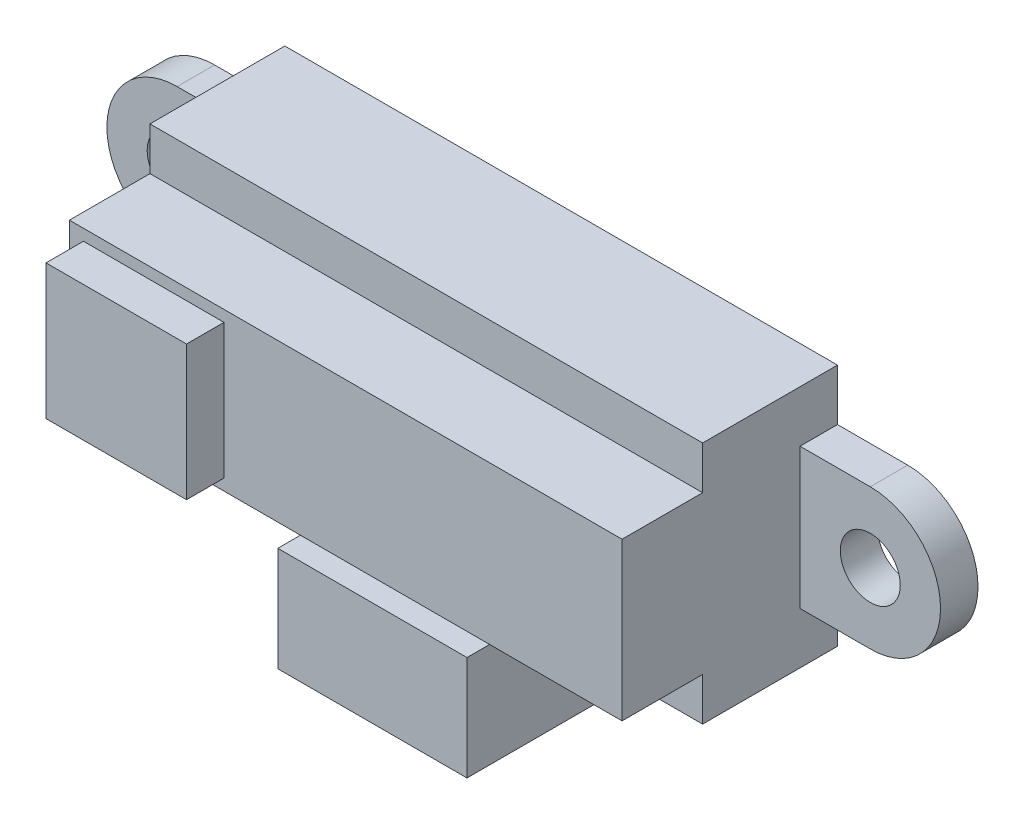
ISO-10303-21;
HEADER;
FILE_DESCRIPTION(('STEP AP214'),'2;1');
FILE_NAME('part.step','',(''),(''),'','','');
FILE_SCHEMA(('AUTOMOTIVE_DESIGN { 1 0 10303 214 1 1 1 1 }'));
ENDSEC;
DATA;
#1=APPLICATION_CONTEXT('core data for automotive mechanical design processes');
#2=APPLICATION_PROTOCOL_DEFINITION('international standard','automotive_design',2000,#1);
#3=PRODUCT_CONTEXT('',#1,'mechanical');
#4=PRODUCT('Part','Part','',(#3));
#5=PRODUCT_RELATED_PRODUCT_CATEGORY('part','',(#4));
#6=PRODUCT_DEFINITION_FORMATION('','',#4);
#7=PRODUCT_DEFINITION_CONTEXT('part definition',#1,'design');
#8=PRODUCT_DEFINITION('design','',#6,#7);
#9=PRODUCT_DEFINITION_SHAPE('','',#8);
#10=(LENGTH_UNIT() NAMED_UNIT(*) SI_UNIT(.MILLI.,.METRE.));
#11=(NAMED_UNIT(*) PLANE_ANGLE_UNIT() SI_UNIT($,.RADIAN.));
#12=(NAMED_UNIT(*) SI_UNIT($,.STERADIAN.) SOLID_ANGLE_UNIT());
#13=UNCERTAINTY_MEASURE_WITH_UNIT(LENGTH_MEASURE(1.E-05),#10,'distance_accuracy_value','');
#14=(GEOMETRIC_REPRESENTATION_CONTEXT(3) GLOBAL_UNCERTAINTY_ASSIGNED_CONTEXT((#13)) GLOBAL_UNIT_ASSIGNED_CONTEXT((#10,
#11,#12)) REPRESENTATION_CONTEXT('',''));
#15=CARTESIAN_POINT('',(0.,0.,0.));
#16=DIRECTION('',(0.,0.,1.));
#17=DIRECTION('',(1.,0.,0.));
#18=AXIS2_PLACEMENT_3D('',#15,#16,#17);
#19=CARTESIAN_POINT('',(-14.75,6.49999999999999,7.2));
#20=DIRECTION('',(1.,0.,0.));
#21=DIRECTION('',(0.,0.,-1.));
#22=AXIS2_PLACEMENT_3D('',#19,#20,#21);
#23=PLANE('',#22);
#24=DIRECTION('',(0.,0.,-1.));
#25=VECTOR('',#24,1.);
#26=CARTESIAN_POINT('',(-14.75,3.75,2.));
#27=LINE('',#26,#25);
#28=CARTESIAN_POINT('',(-14.75,3.75,2.));
#29=VERTEX_POINT('',#28);
#30=CARTESIAN_POINT('',(-14.75,3.75,0.));
#31=VERTEX_POINT('',#30);
#32=EDGE_CURVE('E253',#29,#31,#27,.T.);
#33=ORIENTED_EDGE('',*,*,#32,.F.);
#34=DIRECTION('',(0.,1.,0.));
#35=VECTOR('',#34,1.);
#36=CARTESIAN_POINT('',(-14.75,0.,2.));
#37=LINE('',#36,#35);
#38=CARTESIAN_POINT('',(-14.7499999999999,-3.75,2.));
#39=VERTEX_POINT('',#38);
#40=EDGE_CURVE('E228',#39,#29,#37,.T.);
#41=ORIENTED_EDGE('',*,*,#40,.F.);
#42=DIRECTION('',(0.,0.,-1.));
#43=VECTOR('',#42,1.);
#44=CARTESIAN_POINT('',(-14.7499999999999,-3.75,2.));
#45=LINE('',#44,#43);
#46=CARTESIAN_POINT('',(-14.75,-3.75,0.));
#47=VERTEX_POINT('',#46);
#48=EDGE_CURVE('E224',#39,#47,#45,.T.);
#49=ORIENTED_EDGE('',*,*,#48,.T.);
#50=DIRECTION('',(0.,-1.,0.));
#51=VECTOR('',#50,1.);
#52=CARTESIAN_POINT('',(-14.75,6.49999999999999,0.));
#53=LINE('',#52,#51);
#54=CARTESIAN_POINT('',(-14.75,-6.50000000000001,0.));
#55=VERTEX_POINT('',#54);
#56=EDGE_CURVE('E444',#47,#55,#53,.T.);
#57=ORIENTED_EDGE('',*,*,#56,.T.);
#58=DIRECTION('',(0.,0.,-1.));
#59=VECTOR('',#58,1.);
#60=CARTESIAN_POINT('',(-14.75,-6.50000000000001,7.2));
#61=LINE('',#60,#59);
#62=CARTESIAN_POINT('',(-14.75,-6.50000000000001,7.2));
#63=VERTEX_POINT('',#62);
#64=EDGE_CURVE('E11',#63,#55,#61,.T.);
#65=ORIENTED_EDGE('',*,*,#64,.F.);
#66=DIRECTION('',(0.,-1.,0.));
#67=VECTOR('',#66,1.);
#68=CARTESIAN_POINT('',(-14.75,6.49999999999999,7.2));
#69=LINE('',#68,#67);
#70=CARTESIAN_POINT('',(-14.75,-4.20000000000001,7.2));
#71=VERTEX_POINT('',#70);
#72=EDGE_CURVE('E450',#71,#63,#69,.T.);
#73=ORIENTED_EDGE('',*,*,#72,.F.);
#74=DIRECTION('',(0.,0.,-1.));
#75=VECTOR('',#74,1.);
#76=CARTESIAN_POINT('',(-14.75,-4.20000000000001,11.5));
#77=LINE('',#76,#75);
#78=CARTESIAN_POINT('',(-14.75,-4.20000000000001,11.5));
#79=VERTEX_POINT('',#78);
#80=EDGE_CURVE('E426',#79,#71,#77,.T.);
#81=ORIENTED_EDGE('',*,*,#80,.F.);
#82=DIRECTION('',(0.,-1.,0.));
#83=VECTOR('',#82,1.);
#84=CARTESIAN_POINT('',(-14.75,4.19999999999999,11.5));
#85=LINE('',#84,#83);
#86=CARTESIAN_POINT('',(-14.75,4.19999999999999,11.5));
#87=VERTEX_POINT('',#86);
#88=EDGE_CURVE('E423',#87,#79,#85,.T.);
#89=ORIENTED_EDGE('',*,*,#88,.F.);
#90=DIRECTION('',(0.,0.,-1.));
#91=VECTOR('',#90,1.);
#92=CARTESIAN_POINT('',(-14.75,4.19999999999999,11.5));
#93=LINE('',#92,#91);
#94=CARTESIAN_POINT('',(-14.75,4.19999999999999,7.2));
#95=VERTEX_POINT('',#94);
#96=EDGE_CURVE('E435',#87,#95,#93,.T.);
#97=ORIENTED_EDGE('',*,*,#96,.T.);
#98=CARTESIAN_POINT('',(-14.75,6.49999999999999,7.2));
#99=VERTEX_POINT('',#98);
#100=EDGE_CURVE('E445',#99,#95,#69,.T.);
#101=ORIENTED_EDGE('',*,*,#100,.F.);
#102=DIRECTION('',(0.,0.,-1.));
#103=VECTOR('',#102,1.);
#104=CARTESIAN_POINT('',(-14.75,6.49999999999999,7.2));
#105=LINE('',#104,#103);
#106=CARTESIAN_POINT('',(-14.75,6.49999999999999,0.));
#107=VERTEX_POINT('',#106);
#108=EDGE_CURVE('E463',#99,#107,#105,.T.);
#109=ORIENTED_EDGE('',*,*,#108,.T.);
#110=EDGE_CURVE('E464',#107,#31,#53,.T.);
#111=ORIENTED_EDGE('',*,*,#110,.T.);
#112=EDGE_LOOP('',(#33,#41,#49,#57,#65,#73,#81,#89,#97,#101,#109,#111));
#113=FACE_BOUND('',#112,.T.);
#114=ADVANCED_FACE('F39',(#113),#23,.F.);
#115=CARTESIAN_POINT('',(14.75,6.49999999999999,7.2));
#116=DIRECTION('',(-1.,0.,0.));
#117=DIRECTION('',(0.,0.,1.));
#118=AXIS2_PLACEMENT_3D('',#115,#116,#117);
#119=PLANE('',#118);
#120=DIRECTION('',(0.,0.,-1.));
#121=VECTOR('',#120,1.);
#122=CARTESIAN_POINT('',(14.7499999999999,-3.75,2.));
#123=LINE('',#122,#121);
#124=CARTESIAN_POINT('',(14.7499999999999,-3.75,2.));
#125=VERTEX_POINT('',#124);
#126=CARTESIAN_POINT('',(14.7499999999999,-3.75,0.));
#127=VERTEX_POINT('',#126);
#128=EDGE_CURVE('E291',#125,#127,#123,.T.);
#129=ORIENTED_EDGE('',*,*,#128,.F.);
#130=DIRECTION('',(0.,-1.,0.));
#131=VECTOR('',#130,1.);
#132=CARTESIAN_POINT('',(14.75,0.,2.));
#133=LINE('',#132,#131);
#134=CARTESIAN_POINT('',(14.75,3.75,2.));
#135=VERTEX_POINT('',#134);
#136=EDGE_CURVE('E261',#135,#125,#133,.T.);
#137=ORIENTED_EDGE('',*,*,#136,.F.);
#138=DIRECTION('',(0.,0.,-1.));
#139=VECTOR('',#138,1.);
#140=CARTESIAN_POINT('',(14.75,3.75,2.));
#141=LINE('',#140,#139);
#142=CARTESIAN_POINT('',(14.75,3.75,0.));
#143=VERTEX_POINT('',#142);
#144=EDGE_CURVE('E274',#135,#143,#141,.T.);
#145=ORIENTED_EDGE('',*,*,#144,.T.);
#146=DIRECTION('',(0.,1.,0.));
#147=VECTOR('',#146,1.);
#148=CARTESIAN_POINT('',(14.75,6.49999999999999,0.));
#149=LINE('',#148,#147);
#150=CARTESIAN_POINT('',(14.75,6.49999999999999,0.));
#151=VERTEX_POINT('',#150);
#152=EDGE_CURVE('E471',#143,#151,#149,.T.);
#153=ORIENTED_EDGE('',*,*,#152,.T.);
#154=DIRECTION('',(0.,0.,-1.));
#155=VECTOR('',#154,1.);
#156=CARTESIAN_POINT('',(14.75,6.49999999999999,7.2));
#157=LINE('',#156,#155);
#158=CARTESIAN_POINT('',(14.75,6.49999999999999,7.2));
#159=VERTEX_POINT('',#158);
#160=EDGE_CURVE('E482',#159,#151,#157,.T.);
#161=ORIENTED_EDGE('',*,*,#160,.F.);
#162=DIRECTION('',(0.,1.,0.));
#163=VECTOR('',#162,1.);
#164=CARTESIAN_POINT('',(14.75,6.49999999999999,7.2));
#165=LINE('',#164,#163);
#166=CARTESIAN_POINT('',(14.75,4.19999999999999,7.2));
#167=VERTEX_POINT('',#166);
#168=EDGE_CURVE('E455',#167,#159,#165,.T.);
#169=ORIENTED_EDGE('',*,*,#168,.F.);
#170=DIRECTION('',(0.,0.,-1.));
#171=VECTOR('',#170,1.);
#172=CARTESIAN_POINT('',(14.75,4.19999999999999,11.5));
#173=LINE('',#172,#171);
#174=CARTESIAN_POINT('',(14.75,4.19999999999999,11.5));
#175=VERTEX_POINT('',#174);
#176=EDGE_CURVE('E438',#175,#167,#173,.T.);
#177=ORIENTED_EDGE('',*,*,#176,.F.);
#178=DIRECTION('',(0.,1.,0.));
#179=VECTOR('',#178,1.);
#180=CARTESIAN_POINT('',(14.7499999999999,-4.20000000000001,11.5));
#181=LINE('',#180,#179);
#182=CARTESIAN_POINT('',(14.7499999999999,-4.20000000000001,11.5));
#183=VERTEX_POINT('',#182);
#184=EDGE_CURVE('E415',#183,#175,#181,.T.);
#185=ORIENTED_EDGE('',*,*,#184,.F.);
#186=DIRECTION('',(0.,0.,-1.));
#187=VECTOR('',#186,1.);
#188=CARTESIAN_POINT('',(14.7499999999999,-4.20000000000001,11.5));
#189=LINE('',#188,#187);
#190=CARTESIAN_POINT('',(14.7499999999999,-4.20000000000001,7.2));
#191=VERTEX_POINT('',#190);
#192=EDGE_CURVE('E441',#183,#191,#189,.T.);
#193=ORIENTED_EDGE('',*,*,#192,.T.);
#194=CARTESIAN_POINT('',(14.75,-6.50000000000001,7.2));
#195=VERTEX_POINT('',#194);
#196=EDGE_CURVE('E456',#195,#191,#165,.T.);
#197=ORIENTED_EDGE('',*,*,#196,.F.);
#198=DIRECTION('',(0.,0.,-1.));
#199=VECTOR('',#198,1.);
#200=CARTESIAN_POINT('',(14.75,-6.50000000000001,7.2));
#201=LINE('',#200,#199);
#202=CARTESIAN_POINT('',(14.75,-6.50000000000001,0.));
#203=VERTEX_POINT('',#202);
#204=EDGE_CURVE('E47',#195,#203,#201,.T.);
#205=ORIENTED_EDGE('',*,*,#204,.T.);
#206=EDGE_CURVE('E472',#203,#127,#149,.T.);
#207=ORIENTED_EDGE('',*,*,#206,.T.);
#208=EDGE_LOOP('',(#129,#137,#145,#153,#161,#169,#177,#185,#193,#197,#205,#207));
#209=FACE_BOUND('',#208,.T.);
#210=ADVANCED_FACE('F492',(#209),#119,.F.);
#211=CARTESIAN_POINT('',(0.,0.,11.5));
#212=DIRECTION('',(0.,0.,1.));
#213=DIRECTION('',(1.,0.,0.));
#214=AXIS2_PLACEMENT_3D('',#211,#212,#213);
#215=PLANE('',#214);
#216=DIRECTION('',(1.,0.,0.));
#217=VECTOR('',#216,1.);
#218=CARTESIAN_POINT('',(-14.75,-4.20000000000001,11.5));
#219=LINE('',#218,#217);
#220=EDGE_CURVE('E411',#79,#183,#219,.T.);
#221=ORIENTED_EDGE('',*,*,#220,.T.);
#222=ORIENTED_EDGE('',*,*,#184,.T.);
#223=DIRECTION('',(1.,0.,0.));
#224=VECTOR('',#223,1.);
#225=CARTESIAN_POINT('',(-14.75,4.19999999999999,11.5));
#226=LINE('',#225,#224);
#227=EDGE_CURVE('E419',#87,#175,#226,.T.);
#228=ORIENTED_EDGE('',*,*,#227,.F.);
#229=ORIENTED_EDGE('',*,*,#88,.T.);
#230=EDGE_LOOP('',(#221,#222,#228,#229));
#231=FACE_BOUND('',#230,.T.);
#232=DIRECTION('',(1.,0.,0.));
#233=VECTOR('',#232,1.);
#234=CARTESIAN_POINT('',(-14.,-3.60000000000001,11.5));
#235=LINE('',#234,#233);
#236=CARTESIAN_POINT('',(-14.,-3.60000000000001,11.5));
#237=VERTEX_POINT('',#236);
#238=CARTESIAN_POINT('',(-6.50000000000001,-3.60000000000001,11.5));
#239=VERTEX_POINT('',#238);
#240=EDGE_CURVE('E388',#237,#239,#235,.T.);
#241=ORIENTED_EDGE('',*,*,#240,.F.);
#242=DIRECTION('',(0.,-1.,0.));
#243=VECTOR('',#242,1.);
#244=CARTESIAN_POINT('',(-14.,3.59999999999999,11.5));
#245=LINE('',#244,#243);
#246=CARTESIAN_POINT('',(-14.,3.59999999999999,11.5));
#247=VERTEX_POINT('',#246);
#248=EDGE_CURVE('E369',#247,#237,#245,.T.);
#249=ORIENTED_EDGE('',*,*,#248,.F.);
#250=DIRECTION('',(-1.,0.,0.));
#251=VECTOR('',#250,1.);
#252=CARTESIAN_POINT('',(-6.50000000000001,3.59999999999999,11.5));
#253=LINE('',#252,#251);
#254=CARTESIAN_POINT('',(-6.50000000000001,3.59999999999999,11.5));
#255=VERTEX_POINT('',#254);
#256=EDGE_CURVE('E375',#255,#247,#253,.T.);
#257=ORIENTED_EDGE('',*,*,#256,.F.);
#258=DIRECTION('',(0.,1.,0.));
#259=VECTOR('',#258,1.);
#260=CARTESIAN_POINT('',(-6.50000000000001,-3.60000000000001,11.5));
#261=LINE('',#260,#259);
#262=EDGE_CURVE('E391',#239,#255,#261,.T.);
#263=ORIENTED_EDGE('',*,*,#262,.F.);
#264=EDGE_LOOP('',(#241,#249,#257,#263));
#265=FACE_BOUND('',#264,.T.);
#266=ADVANCED_FACE('F532',(#231,#265),#215,.T.);
#267=CARTESIAN_POINT('',(0.,0.,7.2));
#268=DIRECTION('',(0.,0.,1.));
#269=DIRECTION('',(1.,0.,0.));
#270=AXIS2_PLACEMENT_3D('',#267,#268,#269);
#271=PLANE('',#270);
#272=ORIENTED_EDGE('',*,*,#100,.T.);
#273=DIRECTION('',(1.,0.,0.));
#274=VECTOR('',#273,1.);
#275=CARTESIAN_POINT('',(-14.75,4.19999999999999,7.2));
#276=LINE('',#275,#274);
#277=EDGE_CURVE('E416',#95,#167,#276,.T.);
#278=ORIENTED_EDGE('',*,*,#277,.T.);
#279=ORIENTED_EDGE('',*,*,#168,.T.);
#280=DIRECTION('',(-1.,0.,0.));
#281=VECTOR('',#280,1.);
#282=CARTESIAN_POINT('',(-14.75,6.49999999999999,7.2));
#283=LINE('',#282,#281);
#284=EDGE_CURVE('E460',#159,#99,#283,.T.);
#285=ORIENTED_EDGE('',*,*,#284,.T.);
#286=EDGE_LOOP('',(#272,#278,#279,#285));
#287=FACE_BOUND('',#286,.T.);
#288=ADVANCED_FACE('F633',(#287),#271,.T.);
#289=CARTESIAN_POINT('',(-14.75,-6.50000000000001,7.2));
#290=DIRECTION('',(0.,1.,0.));
#291=DIRECTION('',(0.,0.,1.));
#292=AXIS2_PLACEMENT_3D('',#289,#290,#291);
#293=PLANE('',#292);
#294=DIRECTION('',(0.,0.,-1.));
#295=VECTOR('',#294,1.);
#296=CARTESIAN_POINT('',(-5.05000000000002,-6.50000000000001,4.50000000000007));
#297=LINE('',#296,#295);
#298=CARTESIAN_POINT('',(-5.05000000000002,-6.50000000000001,7.2));
#299=VERTEX_POINT('',#298);
#300=CARTESIAN_POINT('',(-5.05000000000002,-6.50000000000001,3.30000000000007));
#301=VERTEX_POINT('',#300);
#302=EDGE_CURVE('E354',#299,#301,#297,.T.);
#303=ORIENTED_EDGE('',*,*,#302,.F.);
#304=DIRECTION('',(1.,0.,0.));
#305=VECTOR('',#304,1.);
#306=CARTESIAN_POINT('',(-14.75,-6.50000000000001,7.2));
#307=LINE('',#306,#305);
#308=EDGE_CURVE('E451',#63,#299,#307,.T.);
#309=ORIENTED_EDGE('',*,*,#308,.F.);
#310=ORIENTED_EDGE('',*,*,#64,.T.);
#311=DIRECTION('',(1.,0.,0.));
#312=VECTOR('',#311,1.);
#313=CARTESIAN_POINT('',(-14.75,-6.50000000000001,0.));
#314=LINE('',#313,#312);
#315=EDGE_CURVE('E468',#55,#203,#314,.T.);
#316=ORIENTED_EDGE('',*,*,#315,.T.);
#317=ORIENTED_EDGE('',*,*,#204,.F.);
#318=CARTESIAN_POINT('',(5.04999999999998,-6.50000000000001,7.2));
#319=VERTEX_POINT('',#318);
#320=EDGE_CURVE('E449',#319,#195,#307,.T.);
#321=ORIENTED_EDGE('',*,*,#320,.F.);
#322=DIRECTION('',(0.,0.,-1.));
#323=VECTOR('',#322,1.);
#324=CARTESIAN_POINT('',(5.04999999999998,-6.50000000000001,4.50000000000007));
#325=LINE('',#324,#323);
#326=CARTESIAN_POINT('',(5.04999999999998,-6.50000000000001,3.30000000000007));
#327=VERTEX_POINT('',#326);
#328=EDGE_CURVE('E357',#319,#327,#325,.T.);
#329=ORIENTED_EDGE('',*,*,#328,.T.);
#330=DIRECTION('',(-1.,0.,0.));
#331=VECTOR('',#330,1.);
#332=CARTESIAN_POINT('',(5.04999999999998,-6.50000000000001,3.30000000000007));
#333=LINE('',#332,#331);
#334=EDGE_CURVE('E350',#327,#301,#333,.T.);
#335=ORIENTED_EDGE('',*,*,#334,.T.);
#336=EDGE_LOOP('',(#303,#309,#310,#316,#317,#321,#329,#335));
#337=FACE_BOUND('',#336,.T.);
#338=ADVANCED_FACE('F650',(#337),#293,.F.);
#339=CARTESIAN_POINT('',(-14.75,6.49999999999999,7.2));
#340=DIRECTION('',(0.,-1.,0.));
#341=DIRECTION('',(0.,0.,-1.));
#342=AXIS2_PLACEMENT_3D('',#339,#340,#341);
#343=PLANE('',#342);
#344=DIRECTION('',(-1.,0.,0.));
#345=VECTOR('',#344,1.);
#346=CARTESIAN_POINT('',(-14.75,6.49999999999999,0.));
#347=LINE('',#346,#345);
#348=EDGE_CURVE('E476',#151,#107,#347,.T.);
#349=ORIENTED_EDGE('',*,*,#348,.T.);
#350=ORIENTED_EDGE('',*,*,#108,.F.);
#351=ORIENTED_EDGE('',*,*,#284,.F.);
#352=ORIENTED_EDGE('',*,*,#160,.T.);
#353=EDGE_LOOP('',(#349,#350,#351,#352));
#354=FACE_BOUND('',#353,.T.);
#355=ADVANCED_FACE('F645',(#354),#343,.F.);
#356=DIRECTION('',(0.,1.,0.));
#357=VECTOR('',#356,1.);
#358=CARTESIAN_POINT('',(-5.05000000000001,-5.96026463822464,7.2));
#359=LINE('',#358,#357);
#360=CARTESIAN_POINT('',(-5.05000000000001,-5.96026463822464,7.2));
#361=VERTEX_POINT('',#360);
#362=EDGE_CURVE('E296',#299,#361,#359,.T.);
#363=ORIENTED_EDGE('',*,*,#362,.T.);
#364=DIRECTION('',(1.,0.,0.));
#365=VECTOR('',#364,1.);
#366=CARTESIAN_POINT('',(-5.05000000000001,-5.96026463822464,7.2));
#367=LINE('',#366,#365);
#368=CARTESIAN_POINT('',(5.04999999999998,-5.96026463822464,7.2));
#369=VERTEX_POINT('',#368);
#370=EDGE_CURVE('E312',#361,#369,#367,.T.);
#371=ORIENTED_EDGE('',*,*,#370,.T.);
#372=DIRECTION('',(0.,1.,0.));
#373=VECTOR('',#372,1.);
#374=CARTESIAN_POINT('',(5.04999999999998,-5.96026463822464,7.2));
#375=LINE('',#374,#373);
#376=EDGE_CURVE('E295',#319,#369,#375,.T.);
#377=ORIENTED_EDGE('',*,*,#376,.F.);
#378=ORIENTED_EDGE('',*,*,#320,.T.);
#379=ORIENTED_EDGE('',*,*,#196,.T.);
#380=DIRECTION('',(1.,0.,0.));
#381=VECTOR('',#380,1.);
#382=CARTESIAN_POINT('',(-14.75,-4.20000000000001,7.2));
#383=LINE('',#382,#381);
#384=EDGE_CURVE('E410',#71,#191,#383,.T.);
#385=ORIENTED_EDGE('',*,*,#384,.F.);
#386=ORIENTED_EDGE('',*,*,#72,.T.);
#387=ORIENTED_EDGE('',*,*,#308,.T.);
#388=EDGE_LOOP('',(#363,#371,#377,#378,#379,#385,#386,#387));
#389=FACE_BOUND('',#388,.T.);
#390=ADVANCED_FACE('F642',(#389),#271,.T.);
#391=CARTESIAN_POINT('',(0.,0.,0.));
#392=DIRECTION('',(0.,0.,1.));
#393=DIRECTION('',(1.,0.,0.));
#394=AXIS2_PLACEMENT_3D('',#391,#392,#393);
#395=PLANE('',#394);
#396=ORIENTED_EDGE('',*,*,#110,.F.);
#397=ORIENTED_EDGE('',*,*,#348,.F.);
#398=ORIENTED_EDGE('',*,*,#152,.F.);
#399=DIRECTION('',(-1.,0.,0.));
#400=VECTOR('',#399,1.);
#401=CARTESIAN_POINT('',(18.4999999999999,3.75,0.));
#402=LINE('',#401,#400);
#403=CARTESIAN_POINT('',(18.4999999999999,3.75,0.));
#404=VERTEX_POINT('',#403);
#405=EDGE_CURVE('E62',#404,#143,#402,.T.);
#406=ORIENTED_EDGE('',*,*,#405,.F.);
#407=CARTESIAN_POINT('',(18.4999999999999,0.,0.));
#408=DIRECTION('',(0.,0.,1.));
#409=DIRECTION('',(1.,0.,0.));
#410=AXIS2_PLACEMENT_3D('',#407,#408,#409);
#411=CIRCLE('',#410,3.75);
#412=CARTESIAN_POINT('',(18.4999999999999,-3.75,0.));
#413=VERTEX_POINT('',#412);
#414=EDGE_CURVE('E277',#413,#404,#411,.T.);
#415=ORIENTED_EDGE('',*,*,#414,.F.);
#416=DIRECTION('',(1.,0.,0.));
#417=VECTOR('',#416,1.);
#418=CARTESIAN_POINT('',(18.4999999999999,-3.75,0.));
#419=LINE('',#418,#417);
#420=EDGE_CURVE('E259',#127,#413,#419,.T.);
#421=ORIENTED_EDGE('',*,*,#420,.F.);
#422=ORIENTED_EDGE('',*,*,#206,.F.);
#423=ORIENTED_EDGE('',*,*,#315,.F.);
#424=ORIENTED_EDGE('',*,*,#56,.F.);
#425=DIRECTION('',(1.,0.,0.));
#426=VECTOR('',#425,1.);
#427=CARTESIAN_POINT('',(-18.4999999999999,-3.75,0.));
#428=LINE('',#427,#426);
#429=CARTESIAN_POINT('',(-18.4999999999999,-3.75,0.));
#430=VERTEX_POINT('',#429);
#431=EDGE_CURVE('E54',#430,#47,#428,.T.);
#432=ORIENTED_EDGE('',*,*,#431,.F.);
#433=CARTESIAN_POINT('',(-18.4999999999999,0.,0.));
#434=DIRECTION('',(0.,0.,1.));
#435=DIRECTION('',(-1.,0.,0.));
#436=AXIS2_PLACEMENT_3D('',#433,#434,#435);
#437=CIRCLE('',#436,3.75);
#438=CARTESIAN_POINT('',(-18.4999999999999,3.75,0.));
#439=VERTEX_POINT('',#438);
#440=EDGE_CURVE('E244',#439,#430,#437,.T.);
#441=ORIENTED_EDGE('',*,*,#440,.F.);
#442=DIRECTION('',(-1.,0.,0.));
#443=VECTOR('',#442,1.);
#444=CARTESIAN_POINT('',(-18.4999999999999,3.75,0.));
#445=LINE('',#444,#443);
#446=EDGE_CURVE('E240',#31,#439,#445,.T.);
#447=ORIENTED_EDGE('',*,*,#446,.F.);
#448=EDGE_LOOP('',(#396,#397,#398,#406,#415,#421,#422,#423,#424,#432,#441,#447));
#449=FACE_BOUND('',#448,.T.);
#450=CARTESIAN_POINT('',(18.4999999999999,0.,0.));
#451=DIRECTION('',(0.,0.,1.));
#452=DIRECTION('',(1.,0.,0.));
#453=AXIS2_PLACEMENT_3D('',#450,#451,#452);
#454=CIRCLE('',#453,1.6);
#455=CARTESIAN_POINT('',(20.0999999999999,0.,0.));
#456=VERTEX_POINT('',#455);
#457=EDGE_CURVE('E246',#456,#456,#454,.T.);
#458=ORIENTED_EDGE('',*,*,#457,.T.);
#459=EDGE_LOOP('',(#458));
#460=FACE_BOUND('',#459,.T.);
#461=CARTESIAN_POINT('',(-18.4999999999999,0.,0.));
#462=DIRECTION('',(0.,0.,1.));
#463=DIRECTION('',(-1.,0.,0.));
#464=AXIS2_PLACEMENT_3D('',#461,#462,#463);
#465=CIRCLE('',#464,1.6);
#466=CARTESIAN_POINT('',(-20.0999999999999,0.,0.));
#467=VERTEX_POINT('',#466);
#468=EDGE_CURVE('E553',#467,#467,#465,.T.);
#469=ORIENTED_EDGE('',*,*,#468,.T.);
#470=EDGE_LOOP('',(#469));
#471=FACE_BOUND('',#470,.T.);
#472=ADVANCED_FACE('F498',(#449,#460,#471),#395,.F.);
#473=CARTESIAN_POINT('',(-14.75,-4.20000000000001,11.5));
#474=DIRECTION('',(0.,1.,0.));
#475=DIRECTION('',(0.,0.,1.));
#476=AXIS2_PLACEMENT_3D('',#473,#474,#475);
#477=PLANE('',#476);
#478=ORIENTED_EDGE('',*,*,#384,.T.);
#479=ORIENTED_EDGE('',*,*,#192,.F.);
#480=ORIENTED_EDGE('',*,*,#220,.F.);
#481=ORIENTED_EDGE('',*,*,#80,.T.);
#482=EDGE_LOOP('',(#478,#479,#480,#481));
#483=FACE_BOUND('',#482,.T.);
#484=ADVANCED_FACE('F637',(#483),#477,.F.);
#485=CARTESIAN_POINT('',(-14.75,4.19999999999999,11.5));
#486=DIRECTION('',(0.,1.,0.));
#487=DIRECTION('',(0.,0.,1.));
#488=AXIS2_PLACEMENT_3D('',#485,#486,#487);
#489=PLANE('',#488);
#490=ORIENTED_EDGE('',*,*,#277,.F.);
#491=ORIENTED_EDGE('',*,*,#96,.F.);
#492=ORIENTED_EDGE('',*,*,#227,.T.);
#493=ORIENTED_EDGE('',*,*,#176,.T.);
#494=EDGE_LOOP('',(#490,#491,#492,#493));
#495=FACE_BOUND('',#494,.T.);
#496=ADVANCED_FACE('F629',(#495),#489,.T.);
#497=CARTESIAN_POINT('',(-14.,3.59999999999999,13.5));
#498=DIRECTION('',(1.,0.,0.));
#499=DIRECTION('',(0.,1.,0.));
#500=AXIS2_PLACEMENT_3D('',#497,#498,#499);
#501=PLANE('',#500);
#502=ORIENTED_EDGE('',*,*,#248,.T.);
#503=DIRECTION('',(0.,0.,-1.));
#504=VECTOR('',#503,1.);
#505=CARTESIAN_POINT('',(-14.,-3.60000000000001,13.5));
#506=LINE('',#505,#504);
#507=CARTESIAN_POINT('',(-14.,-3.60000000000001,13.5));
#508=VERTEX_POINT('',#507);
#509=EDGE_CURVE('E407',#508,#237,#506,.T.);
#510=ORIENTED_EDGE('',*,*,#509,.F.);
#511=DIRECTION('',(0.,-1.,0.));
#512=VECTOR('',#511,1.);
#513=CARTESIAN_POINT('',(-14.,3.59999999999999,13.5));
#514=LINE('',#513,#512);
#515=CARTESIAN_POINT('',(-14.,3.59999999999999,13.5));
#516=VERTEX_POINT('',#515);
#517=EDGE_CURVE('E370',#516,#508,#514,.T.);
#518=ORIENTED_EDGE('',*,*,#517,.F.);
#519=DIRECTION('',(0.,0.,-1.));
#520=VECTOR('',#519,1.);
#521=CARTESIAN_POINT('',(-14.,3.59999999999999,13.5));
#522=LINE('',#521,#520);
#523=EDGE_CURVE('E384',#516,#247,#522,.T.);
#524=ORIENTED_EDGE('',*,*,#523,.T.);
#525=EDGE_LOOP('',(#502,#510,#518,#524));
#526=FACE_BOUND('',#525,.T.);
#527=ADVANCED_FACE('F625',(#526),#501,.F.);
#528=CARTESIAN_POINT('',(-14.,-3.60000000000001,13.5));
#529=DIRECTION('',(0.,1.,0.));
#530=DIRECTION('',(0.,0.,1.));
#531=AXIS2_PLACEMENT_3D('',#528,#529,#530);
#532=PLANE('',#531);
#533=ORIENTED_EDGE('',*,*,#240,.T.);
#534=DIRECTION('',(0.,0.,-1.));
#535=VECTOR('',#534,1.);
#536=CARTESIAN_POINT('',(-6.50000000000001,-3.60000000000001,13.5));
#537=LINE('',#536,#535);
#538=CARTESIAN_POINT('',(-6.50000000000001,-3.60000000000001,13.5));
#539=VERTEX_POINT('',#538);
#540=EDGE_CURVE('E403',#539,#239,#537,.T.);
#541=ORIENTED_EDGE('',*,*,#540,.F.);
#542=DIRECTION('',(1.,0.,0.));
#543=VECTOR('',#542,1.);
#544=CARTESIAN_POINT('',(-14.,-3.60000000000001,13.5));
#545=LINE('',#544,#543);
#546=EDGE_CURVE('E374',#508,#539,#545,.T.);
#547=ORIENTED_EDGE('',*,*,#546,.F.);
#548=ORIENTED_EDGE('',*,*,#509,.T.);
#549=EDGE_LOOP('',(#533,#541,#547,#548));
#550=FACE_BOUND('',#549,.T.);
#551=ADVANCED_FACE('F621',(#550),#532,.F.);
#552=CARTESIAN_POINT('',(-6.50000000000001,-3.60000000000001,13.5));
#553=DIRECTION('',(-1.,0.,0.));
#554=DIRECTION('',(0.,-1.,0.));
#555=AXIS2_PLACEMENT_3D('',#552,#553,#554);
#556=PLANE('',#555);
#557=ORIENTED_EDGE('',*,*,#262,.T.);
#558=DIRECTION('',(0.,0.,-1.));
#559=VECTOR('',#558,1.);
#560=CARTESIAN_POINT('',(-6.50000000000001,3.59999999999999,13.5));
#561=LINE('',#560,#559);
#562=CARTESIAN_POINT('',(-6.50000000000001,3.59999999999999,13.5));
#563=VERTEX_POINT('',#562);
#564=EDGE_CURVE('E400',#563,#255,#561,.T.);
#565=ORIENTED_EDGE('',*,*,#564,.F.);
#566=DIRECTION('',(0.,1.,0.));
#567=VECTOR('',#566,1.);
#568=CARTESIAN_POINT('',(-6.50000000000001,-3.60000000000001,13.5));
#569=LINE('',#568,#567);
#570=EDGE_CURVE('E378',#539,#563,#569,.T.);
#571=ORIENTED_EDGE('',*,*,#570,.F.);
#572=ORIENTED_EDGE('',*,*,#540,.T.);
#573=EDGE_LOOP('',(#557,#565,#571,#572));
#574=FACE_BOUND('',#573,.T.);
#575=ADVANCED_FACE('F617',(#574),#556,.F.);
#576=CARTESIAN_POINT('',(-6.50000000000001,3.59999999999999,13.5));
#577=DIRECTION('',(0.,-1.,0.));
#578=DIRECTION('',(1.,0.,0.));
#579=AXIS2_PLACEMENT_3D('',#576,#577,#578);
#580=PLANE('',#579);
#581=ORIENTED_EDGE('',*,*,#256,.T.);
#582=ORIENTED_EDGE('',*,*,#523,.F.);
#583=DIRECTION('',(-1.,0.,0.));
#584=VECTOR('',#583,1.);
#585=CARTESIAN_POINT('',(-6.50000000000001,3.59999999999999,13.5));
#586=LINE('',#585,#584);
#587=EDGE_CURVE('E381',#563,#516,#586,.T.);
#588=ORIENTED_EDGE('',*,*,#587,.F.);
#589=ORIENTED_EDGE('',*,*,#564,.T.);
#590=EDGE_LOOP('',(#581,#582,#588,#589));
#591=FACE_BOUND('',#590,.T.);
#592=ADVANCED_FACE('F613',(#591),#580,.F.);
#593=CARTESIAN_POINT('',(0.,0.,13.5));
#594=DIRECTION('',(0.,0.,1.));
#595=DIRECTION('',(1.,0.,0.));
#596=AXIS2_PLACEMENT_3D('',#593,#594,#595);
#597=PLANE('',#596);
#598=ORIENTED_EDGE('',*,*,#517,.T.);
#599=ORIENTED_EDGE('',*,*,#546,.T.);
#600=ORIENTED_EDGE('',*,*,#570,.T.);
#601=ORIENTED_EDGE('',*,*,#587,.T.);
#602=EDGE_LOOP('',(#598,#599,#600,#601));
#603=FACE_BOUND('',#602,.T.);
#604=ADVANCED_FACE('F609',(#603),#597,.T.);
#605=CARTESIAN_POINT('',(-5.05000000000001,-12.4,4.50000000000007));
#606=DIRECTION('',(1.,0.,0.));
#607=DIRECTION('',(0.,1.,0.));
#608=AXIS2_PLACEMENT_3D('',#605,#606,#607);
#609=PLANE('',#608);
#610=DIRECTION('',(0.,-1.,0.));
#611=VECTOR('',#610,1.);
#612=CARTESIAN_POINT('',(-5.05000000000001,-12.4,3.30000000000007));
#613=LINE('',#612,#611);
#614=CARTESIAN_POINT('',(-5.05000000000001,-12.4,3.30000000000007));
#615=VERTEX_POINT('',#614);
#616=EDGE_CURVE('E331',#301,#615,#613,.T.);
#617=ORIENTED_EDGE('',*,*,#616,.T.);
#618=DIRECTION('',(0.,0.,-1.));
#619=VECTOR('',#618,1.);
#620=CARTESIAN_POINT('',(-5.05000000000001,-12.4,4.50000000000007));
#621=LINE('',#620,#619);
#622=CARTESIAN_POINT('',(-5.05000000000001,-12.4,10.077134600143));
#623=VERTEX_POINT('',#622);
#624=EDGE_CURVE('E365',#623,#615,#621,.T.);
#625=ORIENTED_EDGE('',*,*,#624,.F.);
#626=DIRECTION('',(0.,-1.,0.));
#627=VECTOR('',#626,1.);
#628=CARTESIAN_POINT('',(-5.05000000000001,-12.4,10.077134600143));
#629=LINE('',#628,#627);
#630=CARTESIAN_POINT('',(-5.05000000000001,-6.83047926311858,10.077134600143));
#631=VERTEX_POINT('',#630);
#632=EDGE_CURVE('E308',#631,#623,#629,.T.);
#633=ORIENTED_EDGE('',*,*,#632,.F.);
#634=DIRECTION('',(0.,0.,1.));
#635=VECTOR('',#634,1.);
#636=CARTESIAN_POINT('',(-5.05000000000001,-6.83047926311858,10.077134600143));
#637=LINE('',#636,#635);
#638=CARTESIAN_POINT('',(-5.05000000000001,-6.83047926311858,8.50886516491374));
#639=VERTEX_POINT('',#638);
#640=EDGE_CURVE('E304',#639,#631,#637,.T.);
#641=ORIENTED_EDGE('',*,*,#640,.F.);
#642=DIRECTION('',(0.,-0.553659307847889,0.832743280269133));
#643=VECTOR('',#642,1.);
#644=CARTESIAN_POINT('',(-5.05000000000001,-6.83047926311858,8.50886516491374));
#645=LINE('',#644,#643);
#646=EDGE_CURVE('E299',#361,#639,#645,.T.);
#647=ORIENTED_EDGE('',*,*,#646,.F.);
#648=ORIENTED_EDGE('',*,*,#362,.F.);
#649=ORIENTED_EDGE('',*,*,#302,.T.);
#650=EDGE_LOOP('',(#617,#625,#633,#641,#647,#648,#649));
#651=FACE_BOUND('',#650,.T.);
#652=ADVANCED_FACE('F605',(#651),#609,.F.);
#653=CARTESIAN_POINT('',(-5.05000000000001,-12.4,4.50000000000007));
#654=DIRECTION('',(0.,1.,0.));
#655=DIRECTION('',(-1.,0.,0.));
#656=AXIS2_PLACEMENT_3D('',#653,#654,#655);
#657=PLANE('',#656);
#658=DIRECTION('',(1.,0.,0.));
#659=VECTOR('',#658,1.);
#660=CARTESIAN_POINT('',(-5.05000000000001,-12.4,3.30000000000007));
#661=LINE('',#660,#659);
#662=CARTESIAN_POINT('',(5.04999999999998,-12.4,3.30000000000007));
#663=VERTEX_POINT('',#662);
#664=EDGE_CURVE('E343',#615,#663,#661,.T.);
#665=ORIENTED_EDGE('',*,*,#664,.T.);
#666=DIRECTION('',(0.,0.,-1.));
#667=VECTOR('',#666,1.);
#668=CARTESIAN_POINT('',(5.04999999999998,-12.4,4.50000000000007));
#669=LINE('',#668,#667);
#670=CARTESIAN_POINT('',(5.04999999999998,-12.4,10.077134600143));
#671=VERTEX_POINT('',#670);
#672=EDGE_CURVE('E361',#671,#663,#669,.T.);
#673=ORIENTED_EDGE('',*,*,#672,.F.);
#674=DIRECTION('',(1.,0.,0.));
#675=VECTOR('',#674,1.);
#676=CARTESIAN_POINT('',(-5.05000000000001,-12.4,10.077134600143));
#677=LINE('',#676,#675);
#678=EDGE_CURVE('E327',#623,#671,#677,.T.);
#679=ORIENTED_EDGE('',*,*,#678,.F.);
#680=ORIENTED_EDGE('',*,*,#624,.T.);
#681=EDGE_LOOP('',(#665,#673,#679,#680));
#682=FACE_BOUND('',#681,.T.);
#683=ADVANCED_FACE('F601',(#682),#657,.F.);
#684=CARTESIAN_POINT('',(5.04999999999998,-12.4,4.50000000000007));
#685=DIRECTION('',(-1.,0.,0.));
#686=DIRECTION('',(0.,0.,1.));
#687=AXIS2_PLACEMENT_3D('',#684,#685,#686);
#688=PLANE('',#687);
#689=DIRECTION('',(0.,1.,0.));
#690=VECTOR('',#689,1.);
#691=CARTESIAN_POINT('',(5.04999999999998,-12.4,3.30000000000007));
#692=LINE('',#691,#690);
#693=EDGE_CURVE('E346',#663,#327,#692,.T.);
#694=ORIENTED_EDGE('',*,*,#693,.T.);
#695=ORIENTED_EDGE('',*,*,#328,.F.);
#696=ORIENTED_EDGE('',*,*,#376,.T.);
#697=DIRECTION('',(0.,-0.553659307847889,0.832743280269133));
#698=VECTOR('',#697,1.);
#699=CARTESIAN_POINT('',(5.04999999999998,-6.83047926311858,8.50886516491374));
#700=LINE('',#699,#698);
#701=CARTESIAN_POINT('',(5.04999999999998,-6.83047926311858,8.50886516491374));
#702=VERTEX_POINT('',#701);
#703=EDGE_CURVE('E316',#369,#702,#700,.T.);
#704=ORIENTED_EDGE('',*,*,#703,.T.);
#705=DIRECTION('',(0.,0.,1.));
#706=VECTOR('',#705,1.);
#707=CARTESIAN_POINT('',(5.04999999999998,-6.83047926311858,10.077134600143));
#708=LINE('',#707,#706);
#709=CARTESIAN_POINT('',(5.04999999999998,-6.83047926311858,10.077134600143));
#710=VERTEX_POINT('',#709);
#711=EDGE_CURVE('E320',#702,#710,#708,.T.);
#712=ORIENTED_EDGE('',*,*,#711,.T.);
#713=DIRECTION('',(0.,-1.,0.));
#714=VECTOR('',#713,1.);
#715=CARTESIAN_POINT('',(5.04999999999998,-12.4,10.077134600143));
#716=LINE('',#715,#714);
#717=EDGE_CURVE('E300',#710,#671,#716,.T.);
#718=ORIENTED_EDGE('',*,*,#717,.T.);
#719=ORIENTED_EDGE('',*,*,#672,.T.);
#720=EDGE_LOOP('',(#694,#695,#696,#704,#712,#718,#719));
#721=FACE_BOUND('',#720,.T.);
#722=ADVANCED_FACE('F597',(#721),#688,.F.);
#723=CARTESIAN_POINT('',(0.,0.,3.30000000000007));
#724=DIRECTION('',(0.,0.,1.));
#725=DIRECTION('',(1.,0.,0.));
#726=AXIS2_PLACEMENT_3D('',#723,#724,#725);
#727=PLANE('',#726);
#728=ORIENTED_EDGE('',*,*,#616,.F.);
#729=ORIENTED_EDGE('',*,*,#334,.F.);
#730=ORIENTED_EDGE('',*,*,#693,.F.);
#731=ORIENTED_EDGE('',*,*,#664,.F.);
#732=EDGE_LOOP('',(#728,#729,#730,#731));
#733=FACE_BOUND('',#732,.T.);
#734=ADVANCED_FACE('F594',(#733),#727,.F.);
#735=CARTESIAN_POINT('',(-5.05000000000001,-12.4,10.077134600143));
#736=DIRECTION('',(0.,0.,1.));
#737=DIRECTION('',(1.,0.,0.));
#738=AXIS2_PLACEMENT_3D('',#735,#736,#737);
#739=PLANE('',#738);
#740=ORIENTED_EDGE('',*,*,#717,.F.);
#741=DIRECTION('',(1.,0.,0.));
#742=VECTOR('',#741,1.);
#743=CARTESIAN_POINT('',(-5.05000000000001,-6.83047926311858,10.077134600143));
#744=LINE('',#743,#742);
#745=EDGE_CURVE('E332',#631,#710,#744,.T.);
#746=ORIENTED_EDGE('',*,*,#745,.F.);
#747=ORIENTED_EDGE('',*,*,#632,.T.);
#748=ORIENTED_EDGE('',*,*,#678,.T.);
#749=EDGE_LOOP('',(#740,#746,#747,#748));
#750=FACE_BOUND('',#749,.T.);
#751=ADVANCED_FACE('F588',(#750),#739,.T.);
#752=CARTESIAN_POINT('',(-5.05000000000001,-6.83047926311858,10.077134600143));
#753=DIRECTION('',(0.,1.,0.));
#754=DIRECTION('',(0.,0.,1.));
#755=AXIS2_PLACEMENT_3D('',#752,#753,#754);
#756=PLANE('',#755);
#757=ORIENTED_EDGE('',*,*,#711,.F.);
#758=DIRECTION('',(1.,0.,0.));
#759=VECTOR('',#758,1.);
#760=CARTESIAN_POINT('',(-5.05000000000001,-6.83047926311858,8.50886516491374));
#761=LINE('',#760,#759);
#762=EDGE_CURVE('E335',#639,#702,#761,.T.);
#763=ORIENTED_EDGE('',*,*,#762,.F.);
#764=ORIENTED_EDGE('',*,*,#640,.T.);
#765=ORIENTED_EDGE('',*,*,#745,.T.);
#766=EDGE_LOOP('',(#757,#763,#764,#765));
#767=FACE_BOUND('',#766,.T.);
#768=ADVANCED_FACE('F582',(#767),#756,.T.);
#769=CARTESIAN_POINT('',(-5.05000000000001,-6.83047926311858,8.50886516491374));
#770=DIRECTION('',(0.,0.832743280269133,0.55365930784789));
#771=DIRECTION('',(0.,-0.55365930784789,0.832743280269133));
#772=AXIS2_PLACEMENT_3D('',#769,#770,#771);
#773=PLANE('',#772);
#774=ORIENTED_EDGE('',*,*,#703,.F.);
#775=ORIENTED_EDGE('',*,*,#370,.F.);
#776=ORIENTED_EDGE('',*,*,#646,.T.);
#777=ORIENTED_EDGE('',*,*,#762,.T.);
#778=EDGE_LOOP('',(#774,#775,#776,#777));
#779=FACE_BOUND('',#778,.T.);
#780=ADVANCED_FACE('F576',(#779),#773,.T.);
#781=CARTESIAN_POINT('',(18.4999999999999,0.,2.));
#782=DIRECTION('',(0.,0.,1.));
#783=DIRECTION('',(1.,0.,0.));
#784=AXIS2_PLACEMENT_3D('',#781,#782,#783);
#785=PLANE('',#784);
#786=ORIENTED_EDGE('',*,*,#136,.T.);
#787=DIRECTION('',(1.,0.,0.));
#788=VECTOR('',#787,1.);
#789=CARTESIAN_POINT('',(18.4999999999999,-3.75,2.));
#790=LINE('',#789,#788);
#791=CARTESIAN_POINT('',(18.4999999999999,-3.75,2.));
#792=VERTEX_POINT('',#791);
#793=EDGE_CURVE('E265',#125,#792,#790,.T.);
#794=ORIENTED_EDGE('',*,*,#793,.T.);
#795=CARTESIAN_POINT('',(18.4999999999999,0.,2.));
#796=DIRECTION('',(0.,0.,1.));
#797=DIRECTION('',(1.,0.,0.));
#798=AXIS2_PLACEMENT_3D('',#795,#796,#797);
#799=CIRCLE('',#798,3.75);
#800=CARTESIAN_POINT('',(18.4999999999999,3.75,2.));
#801=VERTEX_POINT('',#800);
#802=EDGE_CURVE('E268',#792,#801,#799,.T.);
#803=ORIENTED_EDGE('',*,*,#802,.T.);
#804=DIRECTION('',(-1.,0.,0.));
#805=VECTOR('',#804,1.);
#806=CARTESIAN_POINT('',(18.4999999999999,3.75,2.));
#807=LINE('',#806,#805);
#808=EDGE_CURVE('E271',#801,#135,#807,.T.);
#809=ORIENTED_EDGE('',*,*,#808,.T.);
#810=EDGE_LOOP('',(#786,#794,#803,#809));
#811=FACE_BOUND('',#810,.T.);
#812=CARTESIAN_POINT('',(18.4999999999999,0.,2.));
#813=DIRECTION('',(0.,0.,1.));
#814=DIRECTION('',(1.,0.,0.));
#815=AXIS2_PLACEMENT_3D('',#812,#813,#814);
#816=CIRCLE('',#815,1.6);
#817=CARTESIAN_POINT('',(20.0999999999999,0.,2.));
#818=VERTEX_POINT('',#817);
#819=EDGE_CURVE('E251',#818,#818,#816,.T.);
#820=ORIENTED_EDGE('',*,*,#819,.F.);
#821=EDGE_LOOP('',(#820));
#822=FACE_BOUND('',#821,.T.);
#823=ADVANCED_FACE('F508',(#811,#822),#785,.T.);
#824=CARTESIAN_POINT('',(18.4999999999999,-3.75,2.));
#825=DIRECTION('',(0.,1.,0.));
#826=DIRECTION('',(0.,0.,1.));
#827=AXIS2_PLACEMENT_3D('',#824,#825,#826);
#828=PLANE('',#827);
#829=ORIENTED_EDGE('',*,*,#420,.T.);
#830=DIRECTION('',(0.,0.,-1.));
#831=VECTOR('',#830,1.);
#832=CARTESIAN_POINT('',(18.4999999999999,-3.75,2.));
#833=LINE('',#832,#831);
#834=EDGE_CURVE('E287',#792,#413,#833,.T.);
#835=ORIENTED_EDGE('',*,*,#834,.F.);
#836=ORIENTED_EDGE('',*,*,#793,.F.);
#837=ORIENTED_EDGE('',*,*,#128,.T.);
#838=EDGE_LOOP('',(#829,#835,#836,#837));
#839=FACE_BOUND('',#838,.T.);
#840=ADVANCED_FACE('F504',(#839),#828,.F.);
#841=CARTESIAN_POINT('',(18.4999999999999,0.,2.));
#842=DIRECTION('',(0.,0.,-1.));
#843=DIRECTION('',(-1.,0.,0.));
#844=AXIS2_PLACEMENT_3D('',#841,#842,#843);
#845=CYLINDRICAL_SURFACE('',#844,3.75);
#846=ORIENTED_EDGE('',*,*,#414,.T.);
#847=DIRECTION('',(0.,0.,-1.));
#848=VECTOR('',#847,1.);
#849=CARTESIAN_POINT('',(18.4999999999999,3.75,2.));
#850=LINE('',#849,#848);
#851=EDGE_CURVE('E284',#801,#404,#850,.T.);
#852=ORIENTED_EDGE('',*,*,#851,.F.);
#853=ORIENTED_EDGE('',*,*,#802,.F.);
#854=ORIENTED_EDGE('',*,*,#834,.T.);
#855=EDGE_LOOP('',(#846,#852,#853,#854));
#856=FACE_BOUND('',#855,.T.);
#857=ADVANCED_FACE('F516',(#856),#845,.T.);
#858=CARTESIAN_POINT('',(18.4999999999999,3.75,2.));
#859=DIRECTION('',(0.,-1.,0.));
#860=DIRECTION('',(1.,0.,0.));
#861=AXIS2_PLACEMENT_3D('',#858,#859,#860);
#862=PLANE('',#861);
#863=ORIENTED_EDGE('',*,*,#405,.T.);
#864=ORIENTED_EDGE('',*,*,#144,.F.);
#865=ORIENTED_EDGE('',*,*,#808,.F.);
#866=ORIENTED_EDGE('',*,*,#851,.T.);
#867=EDGE_LOOP('',(#863,#864,#865,#866));
#868=FACE_BOUND('',#867,.T.);
#869=ADVANCED_FACE('F513',(#868),#862,.F.);
#870=CARTESIAN_POINT('',(18.4999999999999,0.,2.));
#871=DIRECTION('',(0.,0.,-1.));
#872=DIRECTION('',(-1.,0.,0.));
#873=AXIS2_PLACEMENT_3D('',#870,#871,#872);
#874=CYLINDRICAL_SURFACE('',#873,1.6);
#875=ORIENTED_EDGE('',*,*,#819,.T.);
#876=EDGE_LOOP('',(#875));
#877=FACE_BOUND('',#876,.T.);
#878=ORIENTED_EDGE('',*,*,#457,.F.);
#879=EDGE_LOOP('',(#878));
#880=FACE_BOUND('',#879,.T.);
#881=ADVANCED_FACE('F515',(#877,#880),#874,.F.);
#882=CARTESIAN_POINT('',(-18.4999999999999,0.,2.));
#883=DIRECTION('',(0.,0.,-1.));
#884=DIRECTION('',(-1.,0.,0.));
#885=AXIS2_PLACEMENT_3D('',#882,#883,#884);
#886=PLANE('',#885);
#887=CARTESIAN_POINT('',(-18.4999999999999,0.,2.));
#888=DIRECTION('',(0.,0.,1.));
#889=DIRECTION('',(-1.,0.,0.));
#890=AXIS2_PLACEMENT_3D('',#887,#888,#889);
#891=CIRCLE('',#890,3.75);
#892=CARTESIAN_POINT('',(-18.4999999999999,3.75,2.));
#893=VERTEX_POINT('',#892);
#894=CARTESIAN_POINT('',(-18.4999999999999,-3.75,2.));
#895=VERTEX_POINT('',#894);
#896=EDGE_CURVE('E229',#893,#895,#891,.T.);
#897=ORIENTED_EDGE('',*,*,#896,.T.);
#898=DIRECTION('',(1.,0.,0.));
#899=VECTOR('',#898,1.);
#900=CARTESIAN_POINT('',(-18.4999999999999,-3.75,2.));
#901=LINE('',#900,#899);
#902=EDGE_CURVE('E218',#895,#39,#901,.T.);
#903=ORIENTED_EDGE('',*,*,#902,.T.);
#904=ORIENTED_EDGE('',*,*,#40,.T.);
#905=DIRECTION('',(-1.,0.,0.));
#906=VECTOR('',#905,1.);
#907=CARTESIAN_POINT('',(-18.4999999999999,3.75,2.));
#908=LINE('',#907,#906);
#909=EDGE_CURVE('E235',#29,#893,#908,.T.);
#910=ORIENTED_EDGE('',*,*,#909,.T.);
#911=EDGE_LOOP('',(#897,#903,#904,#910));
#912=FACE_BOUND('',#911,.T.);
#913=CARTESIAN_POINT('',(-18.4999999999999,0.,2.));
#914=DIRECTION('',(0.,0.,1.));
#915=DIRECTION('',(-1.,0.,0.));
#916=AXIS2_PLACEMENT_3D('',#913,#914,#915);
#917=CIRCLE('',#916,1.6);
#918=CARTESIAN_POINT('',(-20.0999999999999,0.,2.));
#919=VERTEX_POINT('',#918);
#920=EDGE_CURVE('E548',#919,#919,#917,.T.);
#921=ORIENTED_EDGE('',*,*,#920,.F.);
#922=EDGE_LOOP('',(#921));
#923=FACE_BOUND('',#922,.T.);
#924=ADVANCED_FACE('F232',(#912,#923),#886,.F.);
#925=CARTESIAN_POINT('',(-18.4999999999999,0.,2.));
#926=DIRECTION('',(0.,0.,-1.));
#927=DIRECTION('',(-1.,0.,0.));
#928=AXIS2_PLACEMENT_3D('',#925,#926,#927);
#929=CYLINDRICAL_SURFACE('',#928,3.75);
#930=ORIENTED_EDGE('',*,*,#440,.T.);
#931=DIRECTION('',(0.,0.,-1.));
#932=VECTOR('',#931,1.);
#933=CARTESIAN_POINT('',(-18.4999999999999,-3.75,2.));
#934=LINE('',#933,#932);
#935=EDGE_CURVE('E222',#895,#430,#934,.T.);
#936=ORIENTED_EDGE('',*,*,#935,.F.);
#937=ORIENTED_EDGE('',*,*,#896,.F.);
#938=DIRECTION('',(0.,0.,-1.));
#939=VECTOR('',#938,1.);
#940=CARTESIAN_POINT('',(-18.4999999999999,3.75,2.));
#941=LINE('',#940,#939);
#942=EDGE_CURVE('E538',#893,#439,#941,.T.);
#943=ORIENTED_EDGE('',*,*,#942,.T.);
#944=EDGE_LOOP('',(#930,#936,#937,#943));
#945=FACE_BOUND('',#944,.T.);
#946=ADVANCED_FACE('F242',(#945),#929,.T.);
#947=CARTESIAN_POINT('',(-18.4999999999999,-3.75,2.));
#948=DIRECTION('',(0.,1.,0.));
#949=DIRECTION('',(0.,0.,1.));
#950=AXIS2_PLACEMENT_3D('',#947,#948,#949);
#951=PLANE('',#950);
#952=ORIENTED_EDGE('',*,*,#431,.T.);
#953=ORIENTED_EDGE('',*,*,#48,.F.);
#954=ORIENTED_EDGE('',*,*,#902,.F.);
#955=ORIENTED_EDGE('',*,*,#935,.T.);
#956=EDGE_LOOP('',(#952,#953,#954,#955));
#957=FACE_BOUND('',#956,.T.);
#958=ADVANCED_FACE('F220',(#957),#951,.F.);
#959=CARTESIAN_POINT('',(-18.4999999999999,3.75,2.));
#960=DIRECTION('',(0.,-1.,0.));
#961=DIRECTION('',(1.,0.,0.));
#962=AXIS2_PLACEMENT_3D('',#959,#960,#961);
#963=PLANE('',#962);
#964=ORIENTED_EDGE('',*,*,#446,.T.);
#965=ORIENTED_EDGE('',*,*,#942,.F.);
#966=ORIENTED_EDGE('',*,*,#909,.F.);
#967=ORIENTED_EDGE('',*,*,#32,.T.);
#968=EDGE_LOOP('',(#964,#965,#966,#967));
#969=FACE_BOUND('',#968,.T.);
#970=ADVANCED_FACE('F571',(#969),#963,.F.);
#971=CARTESIAN_POINT('',(-18.4999999999999,0.,2.));
#972=DIRECTION('',(0.,0.,-1.));
#973=DIRECTION('',(-1.,0.,0.));
#974=AXIS2_PLACEMENT_3D('',#971,#972,#973);
#975=CYLINDRICAL_SURFACE('',#974,1.6);
#976=ORIENTED_EDGE('',*,*,#920,.T.);
#977=EDGE_LOOP('',(#976));
#978=FACE_BOUND('',#977,.T.);
#979=ORIENTED_EDGE('',*,*,#468,.F.);
#980=EDGE_LOOP('',(#979));
#981=FACE_BOUND('',#980,.T.);
#982=ADVANCED_FACE('F561',(#978,#981),#975,.F.);
#983=CLOSED_SHELL('',(#114,#210,#266,#288,#338,#355,#390,#472,#484,#496,#527,#551,#575,#592,
#604,#652,#683,#722,#734,#751,#768,#780,#823,#840,#857,#869,#881,#924,#946,#958,#970,#982));
#984=MANIFOLD_SOLID_BREP('B2',#983);
#985=ADVANCED_BREP_SHAPE_REPRESENTATION('',(#18,#984),#14);
#986=SHAPE_DEFINITION_REPRESENTATION(#9,#985);
ENDSEC;
END-ISO-10303-21;
